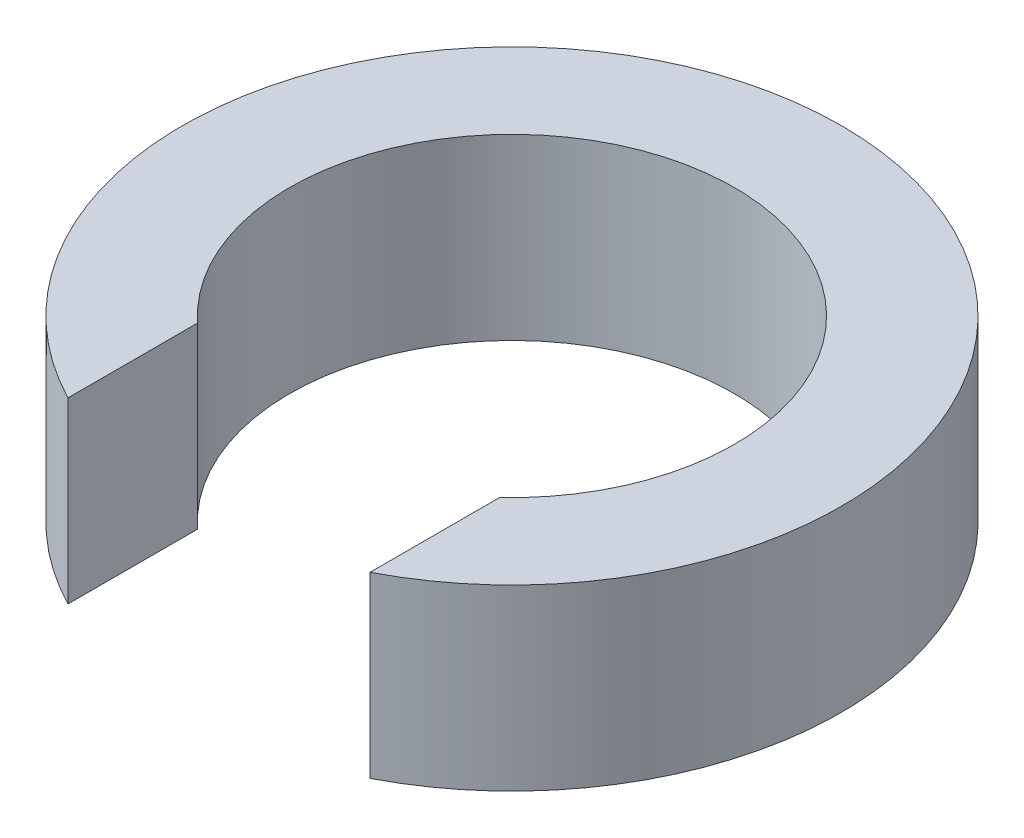
ISO-10303-21;
HEADER;
FILE_DESCRIPTION(('STEP AP214'),'2;1');
FILE_NAME('part.step','',(''),(''),'','','');
FILE_SCHEMA(('AUTOMOTIVE_DESIGN { 1 0 10303 214 1 1 1 1 }'));
ENDSEC;
DATA;
#1=APPLICATION_CONTEXT('core data for automotive mechanical design processes');
#2=APPLICATION_PROTOCOL_DEFINITION('international standard','automotive_design',2000,#1);
#3=PRODUCT_CONTEXT('',#1,'mechanical');
#4=PRODUCT('Part','Part','',(#3));
#5=PRODUCT_RELATED_PRODUCT_CATEGORY('part','',(#4));
#6=PRODUCT_DEFINITION_FORMATION('','',#4);
#7=PRODUCT_DEFINITION_CONTEXT('part definition',#1,'design');
#8=PRODUCT_DEFINITION('design','',#6,#7);
#9=PRODUCT_DEFINITION_SHAPE('','',#8);
#10=(LENGTH_UNIT() NAMED_UNIT(*) SI_UNIT(.MILLI.,.METRE.));
#11=(NAMED_UNIT(*) PLANE_ANGLE_UNIT() SI_UNIT($,.RADIAN.));
#12=(NAMED_UNIT(*) SI_UNIT($,.STERADIAN.) SOLID_ANGLE_UNIT());
#13=UNCERTAINTY_MEASURE_WITH_UNIT(LENGTH_MEASURE(1.E-05),#10,'distance_accuracy_value','');
#14=(GEOMETRIC_REPRESENTATION_CONTEXT(3) GLOBAL_UNCERTAINTY_ASSIGNED_CONTEXT((#13)) GLOBAL_UNIT_ASSIGNED_CONTEXT((#10,
#11,#12)) REPRESENTATION_CONTEXT('',''));
#15=CARTESIAN_POINT('',(0.,0.,0.));
#16=DIRECTION('',(0.,0.,1.));
#17=DIRECTION('',(1.,0.,0.));
#18=AXIS2_PLACEMENT_3D('',#15,#16,#17);
#19=CARTESIAN_POINT('',(0.,3.25,0.));
#20=DIRECTION('',(0.,-1.,0.));
#21=DIRECTION('',(0.,0.,-1.));
#22=AXIS2_PLACEMENT_3D('',#19,#20,#21);
#23=CYLINDRICAL_SURFACE('',#22,4.05);
#24=CARTESIAN_POINT('',(0.,0.,0.));
#25=DIRECTION('',(0.,-1.,0.));
#26=DIRECTION('',(0.,0.,1.));
#27=AXIS2_PLACEMENT_3D('',#24,#25,#26);
#28=CIRCLE('',#27,4.05);
#29=CARTESIAN_POINT('',(-2.75,0.,2.9732137494637));
#30=VERTEX_POINT('',#29);
#31=CARTESIAN_POINT('',(2.75,0.,2.9732137494637));
#32=VERTEX_POINT('',#31);
#33=EDGE_CURVE('E113',#30,#32,#28,.T.);
#34=ORIENTED_EDGE('',*,*,#33,.T.);
#35=DIRECTION('',(0.,-1.,0.));
#36=VECTOR('',#35,1.);
#37=CARTESIAN_POINT('',(2.75,3.25,2.9732137494637));
#38=LINE('',#37,#36);
#39=CARTESIAN_POINT('',(2.75,3.25,2.9732137494637));
#40=VERTEX_POINT('',#39);
#41=EDGE_CURVE('E11',#40,#32,#38,.T.);
#42=ORIENTED_EDGE('',*,*,#41,.F.);
#43=CARTESIAN_POINT('',(0.,3.25,0.));
#44=DIRECTION('',(0.,-1.,0.));
#45=DIRECTION('',(0.,0.,1.));
#46=AXIS2_PLACEMENT_3D('',#43,#44,#45);
#47=CIRCLE('',#46,4.05);
#48=CARTESIAN_POINT('',(-2.75,3.25,2.9732137494637));
#49=VERTEX_POINT('',#48);
#50=EDGE_CURVE('E97',#49,#40,#47,.T.);
#51=ORIENTED_EDGE('',*,*,#50,.F.);
#52=DIRECTION('',(0.,-1.,0.));
#53=VECTOR('',#52,1.);
#54=CARTESIAN_POINT('',(-2.75,3.25,2.9732137494637));
#55=LINE('',#54,#53);
#56=EDGE_CURVE('E109',#49,#30,#55,.T.);
#57=ORIENTED_EDGE('',*,*,#56,.T.);
#58=EDGE_LOOP('',(#34,#42,#51,#57));
#59=FACE_BOUND('',#58,.T.);
#60=ADVANCED_FACE('F45',(#59),#23,.F.);
#61=CARTESIAN_POINT('',(2.75,3.25,2.9732137494637));
#62=DIRECTION('',(1.,0.,0.));
#63=DIRECTION('',(0.,0.,-1.));
#64=AXIS2_PLACEMENT_3D('',#61,#62,#63);
#65=PLANE('',#64);
#66=DIRECTION('',(0.,0.,1.));
#67=VECTOR('',#66,1.);
#68=CARTESIAN_POINT('',(2.75,0.,2.9732137494637));
#69=LINE('',#68,#67);
#70=CARTESIAN_POINT('',(2.75,0.,5.33268225192538));
#71=VERTEX_POINT('',#70);
#72=EDGE_CURVE('E102',#32,#71,#69,.T.);
#73=ORIENTED_EDGE('',*,*,#72,.T.);
#74=DIRECTION('',(0.,-1.,0.));
#75=VECTOR('',#74,1.);
#76=CARTESIAN_POINT('',(2.75,3.25,5.33268225192538));
#77=LINE('',#76,#75);
#78=CARTESIAN_POINT('',(2.75,3.25,5.33268225192538));
#79=VERTEX_POINT('',#78);
#80=EDGE_CURVE('E54',#79,#71,#77,.T.);
#81=ORIENTED_EDGE('',*,*,#80,.F.);
#82=DIRECTION('',(0.,0.,1.));
#83=VECTOR('',#82,1.);
#84=CARTESIAN_POINT('',(2.75,3.25,2.9732137494637));
#85=LINE('',#84,#83);
#86=EDGE_CURVE('E92',#40,#79,#85,.T.);
#87=ORIENTED_EDGE('',*,*,#86,.F.);
#88=ORIENTED_EDGE('',*,*,#41,.T.);
#89=EDGE_LOOP('',(#73,#81,#87,#88));
#90=FACE_BOUND('',#89,.T.);
#91=ADVANCED_FACE('F101',(#90),#65,.F.);
#92=CARTESIAN_POINT('',(0.,3.25,0.));
#93=DIRECTION('',(0.,-1.,0.));
#94=DIRECTION('',(0.,0.,-1.));
#95=AXIS2_PLACEMENT_3D('',#92,#93,#94);
#96=CYLINDRICAL_SURFACE('',#95,6.);
#97=CARTESIAN_POINT('',(0.,0.,0.));
#98=DIRECTION('',(0.,1.,0.));
#99=DIRECTION('',(0.,0.,1.));
#100=AXIS2_PLACEMENT_3D('',#97,#98,#99);
#101=CIRCLE('',#100,6.);
#102=CARTESIAN_POINT('',(-2.75,0.,5.33268225192538));
#103=VERTEX_POINT('',#102);
#104=EDGE_CURVE('E79',#71,#103,#101,.T.);
#105=ORIENTED_EDGE('',*,*,#104,.T.);
#106=DIRECTION('',(0.,-1.,0.));
#107=VECTOR('',#106,1.);
#108=CARTESIAN_POINT('',(-2.75,3.25,5.33268225192538));
#109=LINE('',#108,#107);
#110=CARTESIAN_POINT('',(-2.75,3.25,5.33268225192538));
#111=VERTEX_POINT('',#110);
#112=EDGE_CURVE('E104',#111,#103,#109,.T.);
#113=ORIENTED_EDGE('',*,*,#112,.F.);
#114=CARTESIAN_POINT('',(0.,3.25,0.));
#115=DIRECTION('',(0.,1.,0.));
#116=DIRECTION('',(0.,0.,1.));
#117=AXIS2_PLACEMENT_3D('',#114,#115,#116);
#118=CIRCLE('',#117,6.);
#119=EDGE_CURVE('E95',#79,#111,#118,.T.);
#120=ORIENTED_EDGE('',*,*,#119,.F.);
#121=ORIENTED_EDGE('',*,*,#80,.T.);
#122=EDGE_LOOP('',(#105,#113,#120,#121));
#123=FACE_BOUND('',#122,.T.);
#124=ADVANCED_FACE('F105',(#123),#96,.T.);
#125=CARTESIAN_POINT('',(-2.75,3.25,2.9732137494637));
#126=DIRECTION('',(-1.,0.,0.));
#127=DIRECTION('',(0.,0.,1.));
#128=AXIS2_PLACEMENT_3D('',#125,#126,#127);
#129=PLANE('',#128);
#130=DIRECTION('',(0.,0.,-1.));
#131=VECTOR('',#130,1.);
#132=CARTESIAN_POINT('',(-2.75,0.,2.9732137494637));
#133=LINE('',#132,#131);
#134=EDGE_CURVE('E85',#103,#30,#133,.T.);
#135=ORIENTED_EDGE('',*,*,#134,.T.);
#136=ORIENTED_EDGE('',*,*,#56,.F.);
#137=DIRECTION('',(0.,0.,-1.));
#138=VECTOR('',#137,1.);
#139=CARTESIAN_POINT('',(-2.75,3.25,2.9732137494637));
#140=LINE('',#139,#138);
#141=EDGE_CURVE('E62',#111,#49,#140,.T.);
#142=ORIENTED_EDGE('',*,*,#141,.F.);
#143=ORIENTED_EDGE('',*,*,#112,.T.);
#144=EDGE_LOOP('',(#135,#136,#142,#143));
#145=FACE_BOUND('',#144,.T.);
#146=ADVANCED_FACE('F126',(#145),#129,.F.);
#147=CARTESIAN_POINT('',(0.,3.25,0.));
#148=DIRECTION('',(0.,1.,0.));
#149=DIRECTION('',(0.,0.,1.));
#150=AXIS2_PLACEMENT_3D('',#147,#148,#149);
#151=PLANE('',#150);
#152=ORIENTED_EDGE('',*,*,#50,.T.);
#153=ORIENTED_EDGE('',*,*,#86,.T.);
#154=ORIENTED_EDGE('',*,*,#119,.T.);
#155=ORIENTED_EDGE('',*,*,#141,.T.);
#156=EDGE_LOOP('',(#152,#153,#154,#155));
#157=FACE_BOUND('',#156,.T.);
#158=ADVANCED_FACE('F93',(#157),#151,.T.);
#159=CARTESIAN_POINT('',(0.,0.,0.));
#160=DIRECTION('',(0.,1.,0.));
#161=DIRECTION('',(0.,0.,1.));
#162=AXIS2_PLACEMENT_3D('',#159,#160,#161);
#163=PLANE('',#162);
#164=ORIENTED_EDGE('',*,*,#33,.F.);
#165=ORIENTED_EDGE('',*,*,#134,.F.);
#166=ORIENTED_EDGE('',*,*,#104,.F.);
#167=ORIENTED_EDGE('',*,*,#72,.F.);
#168=EDGE_LOOP('',(#164,#165,#166,#167));
#169=FACE_BOUND('',#168,.T.);
#170=ADVANCED_FACE('F129',(#169),#163,.F.);
#171=CLOSED_SHELL('',(#60,#91,#124,#146,#158,#170));
#172=MANIFOLD_SOLID_BREP('B2',#171);
#173=ADVANCED_BREP_SHAPE_REPRESENTATION('',(#18,#172),#14);
#174=SHAPE_DEFINITION_REPRESENTATION(#9,#173);
ENDSEC;
END-ISO-10303-21;
